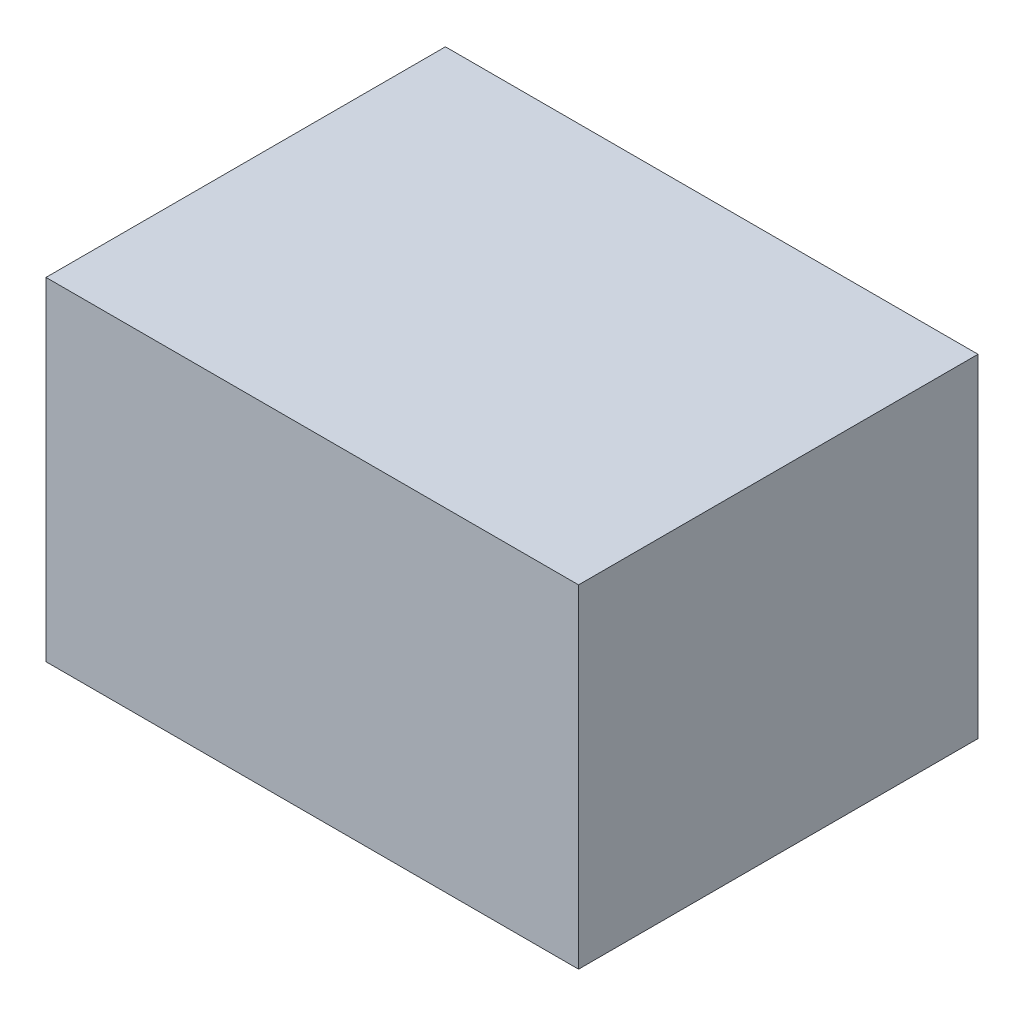
ISO-10303-21;
HEADER;
FILE_DESCRIPTION(('STEP AP214'),'2;1');
FILE_NAME('part.step','',(''),(''),'','','');
FILE_SCHEMA(('AUTOMOTIVE_DESIGN { 1 0 10303 214 1 1 1 1 }'));
ENDSEC;
DATA;
#1=APPLICATION_CONTEXT('core data for automotive mechanical design processes');
#2=APPLICATION_PROTOCOL_DEFINITION('international standard','automotive_design',2000,#1);
#3=PRODUCT_CONTEXT('',#1,'mechanical');
#4=PRODUCT('Part','Part','',(#3));
#5=PRODUCT_RELATED_PRODUCT_CATEGORY('part','',(#4));
#6=PRODUCT_DEFINITION_FORMATION('','',#4);
#7=PRODUCT_DEFINITION_CONTEXT('part definition',#1,'design');
#8=PRODUCT_DEFINITION('design','',#6,#7);
#9=PRODUCT_DEFINITION_SHAPE('','',#8);
#10=(LENGTH_UNIT() NAMED_UNIT(*) SI_UNIT(.MILLI.,.METRE.));
#11=(NAMED_UNIT(*) PLANE_ANGLE_UNIT() SI_UNIT($,.RADIAN.));
#12=(NAMED_UNIT(*) SI_UNIT($,.STERADIAN.) SOLID_ANGLE_UNIT());
#13=UNCERTAINTY_MEASURE_WITH_UNIT(LENGTH_MEASURE(1.E-05),#10,'distance_accuracy_value','');
#14=(GEOMETRIC_REPRESENTATION_CONTEXT(3) GLOBAL_UNCERTAINTY_ASSIGNED_CONTEXT((#13)) GLOBAL_UNIT_ASSIGNED_CONTEXT((#10,
#11,#12)) REPRESENTATION_CONTEXT('',''));
#15=CARTESIAN_POINT('',(0.,0.,0.));
#16=DIRECTION('',(0.,0.,1.));
#17=DIRECTION('',(1.,0.,0.));
#18=AXIS2_PLACEMENT_3D('',#15,#16,#17);
#19=CARTESIAN_POINT('',(0.,500.,0.));
#20=DIRECTION('',(1.,0.,0.));
#21=DIRECTION('',(0.,0.,-1.));
#22=AXIS2_PLACEMENT_3D('',#19,#20,#21);
#23=PLANE('',#22);
#24=DIRECTION('',(0.,0.,1.));
#25=VECTOR('',#24,1.);
#26=CARTESIAN_POINT('',(0.,0.,0.));
#27=LINE('',#26,#25);
#28=CARTESIAN_POINT('',(-1.10218211923262E-13,0.,-600.));
#29=VERTEX_POINT('',#28);
#30=CARTESIAN_POINT('',(0.,0.,0.));
#31=VERTEX_POINT('',#30);
#32=EDGE_CURVE('E109',#29,#31,#27,.T.);
#33=ORIENTED_EDGE('',*,*,#32,.T.);
#34=DIRECTION('',(0.,-1.,0.));
#35=VECTOR('',#34,1.);
#36=CARTESIAN_POINT('',(0.,500.,0.));
#37=LINE('',#36,#35);
#38=CARTESIAN_POINT('',(0.,500.,0.));
#39=VERTEX_POINT('',#38);
#40=EDGE_CURVE('E11',#39,#31,#37,.T.);
#41=ORIENTED_EDGE('',*,*,#40,.F.);
#42=DIRECTION('',(0.,0.,1.));
#43=VECTOR('',#42,1.);
#44=CARTESIAN_POINT('',(0.,500.,0.));
#45=LINE('',#44,#43);
#46=CARTESIAN_POINT('',(-1.10218211923262E-13,500.,-600.));
#47=VERTEX_POINT('',#46);
#48=EDGE_CURVE('E93',#47,#39,#45,.T.);
#49=ORIENTED_EDGE('',*,*,#48,.F.);
#50=DIRECTION('',(0.,-1.,0.));
#51=VECTOR('',#50,1.);
#52=CARTESIAN_POINT('',(-1.10218211923262E-13,500.,-600.));
#53=LINE('',#52,#51);
#54=EDGE_CURVE('E105',#47,#29,#53,.T.);
#55=ORIENTED_EDGE('',*,*,#54,.T.);
#56=EDGE_LOOP('',(#33,#41,#49,#55));
#57=FACE_BOUND('',#56,.T.);
#58=ADVANCED_FACE('F41',(#57),#23,.F.);
#59=CARTESIAN_POINT('',(0.,500.,0.));
#60=DIRECTION('',(0.,0.,-1.));
#61=DIRECTION('',(-1.,0.,0.));
#62=AXIS2_PLACEMENT_3D('',#59,#60,#61);
#63=PLANE('',#62);
#64=DIRECTION('',(1.,0.,0.));
#65=VECTOR('',#64,1.);
#66=CARTESIAN_POINT('',(0.,0.,0.));
#67=LINE('',#66,#65);
#68=CARTESIAN_POINT('',(800.,0.,0.));
#69=VERTEX_POINT('',#68);
#70=EDGE_CURVE('E98',#31,#69,#67,.T.);
#71=ORIENTED_EDGE('',*,*,#70,.T.);
#72=DIRECTION('',(0.,-1.,0.));
#73=VECTOR('',#72,1.);
#74=CARTESIAN_POINT('',(800.,500.,0.));
#75=LINE('',#74,#73);
#76=CARTESIAN_POINT('',(800.,500.,0.));
#77=VERTEX_POINT('',#76);
#78=EDGE_CURVE('E50',#77,#69,#75,.T.);
#79=ORIENTED_EDGE('',*,*,#78,.F.);
#80=DIRECTION('',(1.,0.,0.));
#81=VECTOR('',#80,1.);
#82=CARTESIAN_POINT('',(0.,500.,0.));
#83=LINE('',#82,#81);
#84=EDGE_CURVE('E88',#39,#77,#83,.T.);
#85=ORIENTED_EDGE('',*,*,#84,.F.);
#86=ORIENTED_EDGE('',*,*,#40,.T.);
#87=EDGE_LOOP('',(#71,#79,#85,#86));
#88=FACE_BOUND('',#87,.T.);
#89=ADVANCED_FACE('F97',(#88),#63,.F.);
#90=CARTESIAN_POINT('',(800.,500.,0.));
#91=DIRECTION('',(-1.,0.,0.));
#92=DIRECTION('',(0.,0.,1.));
#93=AXIS2_PLACEMENT_3D('',#90,#91,#92);
#94=PLANE('',#93);
#95=DIRECTION('',(0.,0.,-1.));
#96=VECTOR('',#95,1.);
#97=CARTESIAN_POINT('',(800.,0.,0.));
#98=LINE('',#97,#96);
#99=CARTESIAN_POINT('',(800.,0.,-600.));
#100=VERTEX_POINT('',#99);
#101=EDGE_CURVE('E75',#69,#100,#98,.T.);
#102=ORIENTED_EDGE('',*,*,#101,.T.);
#103=DIRECTION('',(0.,-1.,0.));
#104=VECTOR('',#103,1.);
#105=CARTESIAN_POINT('',(800.,500.,-600.));
#106=LINE('',#105,#104);
#107=CARTESIAN_POINT('',(800.,500.,-600.));
#108=VERTEX_POINT('',#107);
#109=EDGE_CURVE('E100',#108,#100,#106,.T.);
#110=ORIENTED_EDGE('',*,*,#109,.F.);
#111=DIRECTION('',(0.,0.,-1.));
#112=VECTOR('',#111,1.);
#113=CARTESIAN_POINT('',(800.,500.,0.));
#114=LINE('',#113,#112);
#115=EDGE_CURVE('E91',#77,#108,#114,.T.);
#116=ORIENTED_EDGE('',*,*,#115,.F.);
#117=ORIENTED_EDGE('',*,*,#78,.T.);
#118=EDGE_LOOP('',(#102,#110,#116,#117));
#119=FACE_BOUND('',#118,.T.);
#120=ADVANCED_FACE('F101',(#119),#94,.F.);
#121=CARTESIAN_POINT('',(-1.10218211923262E-13,500.,-600.));
#122=DIRECTION('',(0.,0.,1.));
#123=DIRECTION('',(1.,0.,0.));
#124=AXIS2_PLACEMENT_3D('',#121,#122,#123);
#125=PLANE('',#124);
#126=DIRECTION('',(-1.,0.,0.));
#127=VECTOR('',#126,1.);
#128=CARTESIAN_POINT('',(-1.10218211923262E-13,0.,-600.));
#129=LINE('',#128,#127);
#130=EDGE_CURVE('E81',#100,#29,#129,.T.);
#131=ORIENTED_EDGE('',*,*,#130,.T.);
#132=ORIENTED_EDGE('',*,*,#54,.F.);
#133=DIRECTION('',(-1.,0.,0.));
#134=VECTOR('',#133,1.);
#135=CARTESIAN_POINT('',(-1.10218211923262E-13,500.,-600.));
#136=LINE('',#135,#134);
#137=EDGE_CURVE('E58',#108,#47,#136,.T.);
#138=ORIENTED_EDGE('',*,*,#137,.F.);
#139=ORIENTED_EDGE('',*,*,#109,.T.);
#140=EDGE_LOOP('',(#131,#132,#138,#139));
#141=FACE_BOUND('',#140,.T.);
#142=ADVANCED_FACE('F122',(#141),#125,.F.);
#143=CARTESIAN_POINT('',(0.,500.,0.));
#144=DIRECTION('',(0.,-1.,0.));
#145=DIRECTION('',(0.,0.,-1.));
#146=AXIS2_PLACEMENT_3D('',#143,#144,#145);
#147=PLANE('',#146);
#148=ORIENTED_EDGE('',*,*,#48,.T.);
#149=ORIENTED_EDGE('',*,*,#84,.T.);
#150=ORIENTED_EDGE('',*,*,#115,.T.);
#151=ORIENTED_EDGE('',*,*,#137,.T.);
#152=EDGE_LOOP('',(#148,#149,#150,#151));
#153=FACE_BOUND('',#152,.T.);
#154=ADVANCED_FACE('F89',(#153),#147,.F.);
#155=CARTESIAN_POINT('',(0.,0.,0.));
#156=DIRECTION('',(0.,-1.,0.));
#157=DIRECTION('',(0.,0.,-1.));
#158=AXIS2_PLACEMENT_3D('',#155,#156,#157);
#159=PLANE('',#158);
#160=ORIENTED_EDGE('',*,*,#32,.F.);
#161=ORIENTED_EDGE('',*,*,#130,.F.);
#162=ORIENTED_EDGE('',*,*,#101,.F.);
#163=ORIENTED_EDGE('',*,*,#70,.F.);
#164=EDGE_LOOP('',(#160,#161,#162,#163));
#165=FACE_BOUND('',#164,.T.);
#166=ADVANCED_FACE('F125',(#165),#159,.T.);
#167=CLOSED_SHELL('',(#58,#89,#120,#142,#154,#166));
#168=MANIFOLD_SOLID_BREP('B2',#167);
#169=ADVANCED_BREP_SHAPE_REPRESENTATION('',(#18,#168),#14);
#170=SHAPE_DEFINITION_REPRESENTATION(#9,#169);
ENDSEC;
END-ISO-10303-21;
